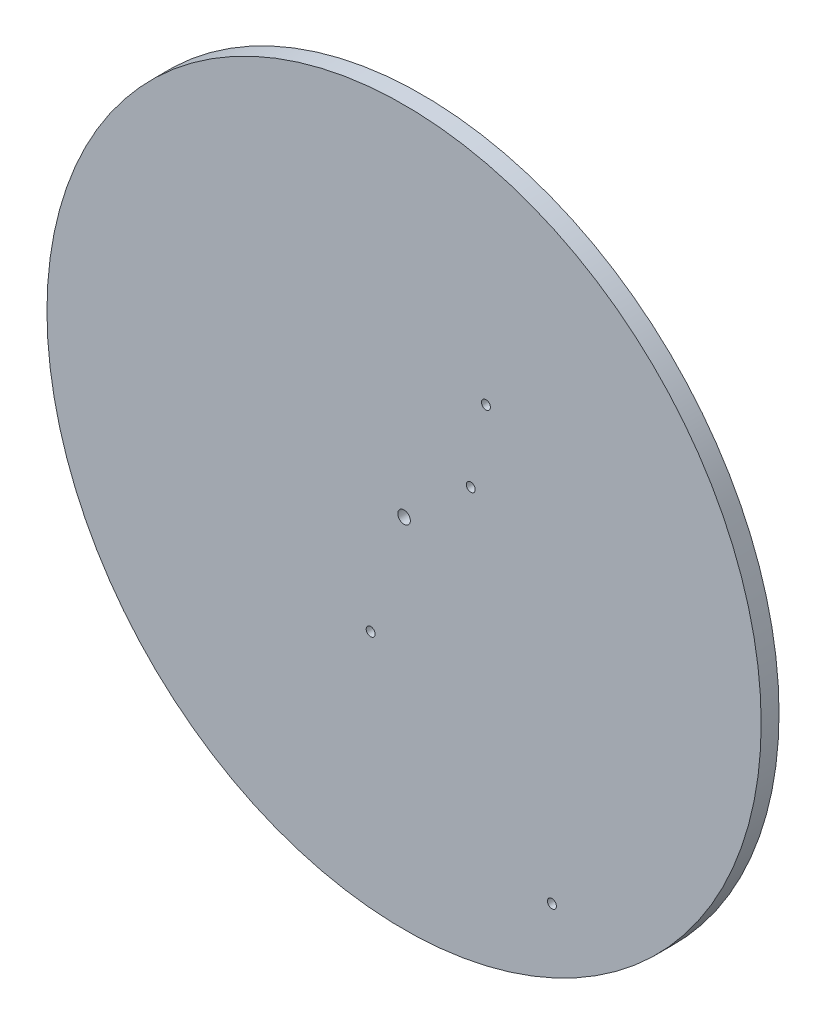
ISO-10303-21;
HEADER;
FILE_DESCRIPTION(('STEP AP214'),'2;1');
FILE_NAME('part.step','',(''),(''),'','','');
FILE_SCHEMA(('AUTOMOTIVE_DESIGN { 1 0 10303 214 1 1 1 1 }'));
ENDSEC;
DATA;
#1=APPLICATION_CONTEXT('core data for automotive mechanical design processes');
#2=APPLICATION_PROTOCOL_DEFINITION('international standard','automotive_design',2000,#1);
#3=PRODUCT_CONTEXT('',#1,'mechanical');
#4=PRODUCT('Part','Part','',(#3));
#5=PRODUCT_RELATED_PRODUCT_CATEGORY('part','',(#4));
#6=PRODUCT_DEFINITION_FORMATION('','',#4);
#7=PRODUCT_DEFINITION_CONTEXT('part definition',#1,'design');
#8=PRODUCT_DEFINITION('design','',#6,#7);
#9=PRODUCT_DEFINITION_SHAPE('','',#8);
#10=(LENGTH_UNIT() NAMED_UNIT(*) SI_UNIT(.MILLI.,.METRE.));
#11=(NAMED_UNIT(*) PLANE_ANGLE_UNIT() SI_UNIT($,.RADIAN.));
#12=(NAMED_UNIT(*) SI_UNIT($,.STERADIAN.) SOLID_ANGLE_UNIT());
#13=UNCERTAINTY_MEASURE_WITH_UNIT(LENGTH_MEASURE(1.E-05),#10,'distance_accuracy_value','');
#14=(GEOMETRIC_REPRESENTATION_CONTEXT(3) GLOBAL_UNCERTAINTY_ASSIGNED_CONTEXT((#13)) GLOBAL_UNIT_ASSIGNED_CONTEXT((#10,
#11,#12)) REPRESENTATION_CONTEXT('',''));
#15=CARTESIAN_POINT('',(0.,0.,0.));
#16=DIRECTION('',(0.,0.,1.));
#17=DIRECTION('',(1.,0.,0.));
#18=AXIS2_PLACEMENT_3D('',#15,#16,#17);
#19=CARTESIAN_POINT('',(0.,0.,10.));
#20=DIRECTION('',(0.,0.,1.));
#21=DIRECTION('',(1.,0.,0.));
#22=AXIS2_PLACEMENT_3D('',#19,#20,#21);
#23=PLANE('',#22);
#24=CARTESIAN_POINT('',(82.82,-146.05,10.));
#25=DIRECTION('',(0.,0.,1.));
#26=DIRECTION('',(1.,0.,0.));
#27=AXIS2_PLACEMENT_3D('',#24,#25,#26);
#28=CIRCLE('',#27,2.50000000000001);
#29=CARTESIAN_POINT('',(85.32,-146.05,10.));
#30=VERTEX_POINT('',#29);
#31=EDGE_CURVE('E71',#30,#30,#28,.T.);
#32=ORIENTED_EDGE('',*,*,#31,.F.);
#33=EDGE_LOOP('',(#32));
#34=FACE_BOUND('',#33,.T.);
#35=CARTESIAN_POINT('',(-18.71,-64.86,10.));
#36=DIRECTION('',(0.,0.,1.));
#37=DIRECTION('',(1.,0.,0.));
#38=AXIS2_PLACEMENT_3D('',#35,#36,#37);
#39=CIRCLE('',#38,2.5);
#40=CARTESIAN_POINT('',(-16.21,-64.86,10.));
#41=VERTEX_POINT('',#40);
#42=EDGE_CURVE('E65',#41,#41,#39,.T.);
#43=ORIENTED_EDGE('',*,*,#42,.F.);
#44=EDGE_LOOP('',(#43));
#45=FACE_BOUND('',#44,.T.);
#46=CARTESIAN_POINT('',(45.86,77.44,10.));
#47=DIRECTION('',(0.,0.,1.));
#48=DIRECTION('',(1.,0.,0.));
#49=AXIS2_PLACEMENT_3D('',#46,#47,#48);
#50=CIRCLE('',#49,2.5);
#51=CARTESIAN_POINT('',(48.36,77.44,10.));
#52=VERTEX_POINT('',#51);
#53=EDGE_CURVE('E59',#52,#52,#50,.T.);
#54=ORIENTED_EDGE('',*,*,#53,.F.);
#55=EDGE_LOOP('',(#54));
#56=FACE_BOUND('',#55,.T.);
#57=CARTESIAN_POINT('',(37.34,33.25,10.));
#58=DIRECTION('',(0.,0.,1.));
#59=DIRECTION('',(1.,0.,0.));
#60=AXIS2_PLACEMENT_3D('',#57,#58,#59);
#61=CIRCLE('',#60,2.5);
#62=CARTESIAN_POINT('',(39.84,33.25,10.));
#63=VERTEX_POINT('',#62);
#64=EDGE_CURVE('E53',#63,#63,#61,.T.);
#65=ORIENTED_EDGE('',*,*,#64,.F.);
#66=EDGE_LOOP('',(#65));
#67=FACE_BOUND('',#66,.T.);
#68=CARTESIAN_POINT('',(0.,0.,10.));
#69=DIRECTION('',(0.,0.,1.));
#70=DIRECTION('',(1.,0.,0.));
#71=AXIS2_PLACEMENT_3D('',#68,#69,#70);
#72=CIRCLE('',#71,200.);
#73=CARTESIAN_POINT('',(200.,0.,10.));
#74=VERTEX_POINT('',#73);
#75=EDGE_CURVE('E10',#74,#74,#72,.T.);
#76=ORIENTED_EDGE('',*,*,#75,.T.);
#77=EDGE_LOOP('',(#76));
#78=FACE_BOUND('',#77,.T.);
#79=CARTESIAN_POINT('',(0.,0.,10.));
#80=DIRECTION('',(0.,0.,1.));
#81=DIRECTION('',(1.,0.,0.));
#82=AXIS2_PLACEMENT_3D('',#79,#80,#81);
#83=CIRCLE('',#82,3.5);
#84=CARTESIAN_POINT('',(3.5,0.,10.));
#85=VERTEX_POINT('',#84);
#86=EDGE_CURVE('E45',#85,#85,#83,.T.);
#87=ORIENTED_EDGE('',*,*,#86,.F.);
#88=EDGE_LOOP('',(#87));
#89=FACE_BOUND('',#88,.T.);
#90=ADVANCED_FACE('F34',(#34,#45,#56,#67,#78,#89),#23,.T.);
#91=CARTESIAN_POINT('',(0.,0.,0.));
#92=DIRECTION('',(0.,0.,1.));
#93=DIRECTION('',(1.,0.,0.));
#94=AXIS2_PLACEMENT_3D('',#91,#92,#93);
#95=PLANE('',#94);
#96=CARTESIAN_POINT('',(82.82,-146.05,0.));
#97=DIRECTION('',(0.,0.,1.));
#98=DIRECTION('',(1.,0.,0.));
#99=AXIS2_PLACEMENT_3D('',#96,#97,#98);
#100=CIRCLE('',#99,2.50000000000001);
#101=CARTESIAN_POINT('',(85.32,-146.05,0.));
#102=VERTEX_POINT('',#101);
#103=EDGE_CURVE('E68',#102,#102,#100,.T.);
#104=ORIENTED_EDGE('',*,*,#103,.T.);
#105=EDGE_LOOP('',(#104));
#106=FACE_BOUND('',#105,.T.);
#107=CARTESIAN_POINT('',(-18.71,-64.86,0.));
#108=DIRECTION('',(0.,0.,1.));
#109=DIRECTION('',(1.,0.,0.));
#110=AXIS2_PLACEMENT_3D('',#107,#108,#109);
#111=CIRCLE('',#110,2.5);
#112=CARTESIAN_POINT('',(-16.21,-64.86,0.));
#113=VERTEX_POINT('',#112);
#114=EDGE_CURVE('E62',#113,#113,#111,.T.);
#115=ORIENTED_EDGE('',*,*,#114,.T.);
#116=EDGE_LOOP('',(#115));
#117=FACE_BOUND('',#116,.T.);
#118=CARTESIAN_POINT('',(45.86,77.44,0.));
#119=DIRECTION('',(0.,0.,1.));
#120=DIRECTION('',(1.,0.,0.));
#121=AXIS2_PLACEMENT_3D('',#118,#119,#120);
#122=CIRCLE('',#121,2.5);
#123=CARTESIAN_POINT('',(48.36,77.44,0.));
#124=VERTEX_POINT('',#123);
#125=EDGE_CURVE('E56',#124,#124,#122,.T.);
#126=ORIENTED_EDGE('',*,*,#125,.T.);
#127=EDGE_LOOP('',(#126));
#128=FACE_BOUND('',#127,.T.);
#129=CARTESIAN_POINT('',(37.34,33.25,0.));
#130=DIRECTION('',(0.,0.,1.));
#131=DIRECTION('',(1.,0.,0.));
#132=AXIS2_PLACEMENT_3D('',#129,#130,#131);
#133=CIRCLE('',#132,2.5);
#134=CARTESIAN_POINT('',(39.84,33.25,0.));
#135=VERTEX_POINT('',#134);
#136=EDGE_CURVE('E50',#135,#135,#133,.T.);
#137=ORIENTED_EDGE('',*,*,#136,.T.);
#138=EDGE_LOOP('',(#137));
#139=FACE_BOUND('',#138,.T.);
#140=CARTESIAN_POINT('',(0.,0.,0.));
#141=DIRECTION('',(0.,0.,1.));
#142=DIRECTION('',(1.,0.,0.));
#143=AXIS2_PLACEMENT_3D('',#140,#141,#142);
#144=CIRCLE('',#143,200.);
#145=CARTESIAN_POINT('',(200.,0.,0.));
#146=VERTEX_POINT('',#145);
#147=EDGE_CURVE('E38',#146,#146,#144,.T.);
#148=ORIENTED_EDGE('',*,*,#147,.F.);
#149=EDGE_LOOP('',(#148));
#150=FACE_BOUND('',#149,.T.);
#151=CARTESIAN_POINT('',(0.,0.,0.));
#152=DIRECTION('',(0.,0.,1.));
#153=DIRECTION('',(1.,0.,0.));
#154=AXIS2_PLACEMENT_3D('',#151,#152,#153);
#155=CIRCLE('',#154,3.5);
#156=CARTESIAN_POINT('',(3.5,0.,0.));
#157=VERTEX_POINT('',#156);
#158=EDGE_CURVE('E47',#157,#157,#155,.T.);
#159=ORIENTED_EDGE('',*,*,#158,.T.);
#160=EDGE_LOOP('',(#159));
#161=FACE_BOUND('',#160,.T.);
#162=ADVANCED_FACE('F77',(#106,#117,#128,#139,#150,#161),#95,.F.);
#163=CARTESIAN_POINT('',(0.,0.,10.));
#164=DIRECTION('',(0.,0.,-1.));
#165=DIRECTION('',(-1.,0.,0.));
#166=AXIS2_PLACEMENT_3D('',#163,#164,#165);
#167=CYLINDRICAL_SURFACE('',#166,200.);
#168=ORIENTED_EDGE('',*,*,#75,.F.);
#169=EDGE_LOOP('',(#168));
#170=FACE_BOUND('',#169,.T.);
#171=ORIENTED_EDGE('',*,*,#147,.T.);
#172=EDGE_LOOP('',(#171));
#173=FACE_BOUND('',#172,.T.);
#174=ADVANCED_FACE('F36',(#170,#173),#167,.T.);
#175=CARTESIAN_POINT('',(0.,0.,10.));
#176=DIRECTION('',(0.,0.,-1.));
#177=DIRECTION('',(-1.,0.,0.));
#178=AXIS2_PLACEMENT_3D('',#175,#176,#177);
#179=CYLINDRICAL_SURFACE('',#178,3.5);
#180=ORIENTED_EDGE('',*,*,#86,.T.);
#181=EDGE_LOOP('',(#180));
#182=FACE_BOUND('',#181,.T.);
#183=ORIENTED_EDGE('',*,*,#158,.F.);
#184=EDGE_LOOP('',(#183));
#185=FACE_BOUND('',#184,.T.);
#186=ADVANCED_FACE('F98',(#182,#185),#179,.F.);
#187=CARTESIAN_POINT('',(37.34,33.25,0.));
#188=DIRECTION('',(0.,0.,1.));
#189=DIRECTION('',(1.,0.,0.));
#190=AXIS2_PLACEMENT_3D('',#187,#188,#189);
#191=CYLINDRICAL_SURFACE('',#190,2.5);
#192=ORIENTED_EDGE('',*,*,#136,.F.);
#193=EDGE_LOOP('',(#192));
#194=FACE_BOUND('',#193,.T.);
#195=ORIENTED_EDGE('',*,*,#64,.T.);
#196=EDGE_LOOP('',(#195));
#197=FACE_BOUND('',#196,.T.);
#198=ADVANCED_FACE('F101',(#194,#197),#191,.F.);
#199=CARTESIAN_POINT('',(45.86,77.44,0.));
#200=DIRECTION('',(0.,0.,1.));
#201=DIRECTION('',(1.,0.,0.));
#202=AXIS2_PLACEMENT_3D('',#199,#200,#201);
#203=CYLINDRICAL_SURFACE('',#202,2.5);
#204=ORIENTED_EDGE('',*,*,#125,.F.);
#205=EDGE_LOOP('',(#204));
#206=FACE_BOUND('',#205,.T.);
#207=ORIENTED_EDGE('',*,*,#53,.T.);
#208=EDGE_LOOP('',(#207));
#209=FACE_BOUND('',#208,.T.);
#210=ADVANCED_FACE('F113',(#206,#209),#203,.F.);
#211=CARTESIAN_POINT('',(-18.71,-64.86,0.));
#212=DIRECTION('',(0.,0.,1.));
#213=DIRECTION('',(1.,0.,0.));
#214=AXIS2_PLACEMENT_3D('',#211,#212,#213);
#215=CYLINDRICAL_SURFACE('',#214,2.5);
#216=ORIENTED_EDGE('',*,*,#114,.F.);
#217=EDGE_LOOP('',(#216));
#218=FACE_BOUND('',#217,.T.);
#219=ORIENTED_EDGE('',*,*,#42,.T.);
#220=EDGE_LOOP('',(#219));
#221=FACE_BOUND('',#220,.T.);
#222=ADVANCED_FACE('F83',(#218,#221),#215,.F.);
#223=CARTESIAN_POINT('',(82.82,-146.05,0.));
#224=DIRECTION('',(0.,0.,1.));
#225=DIRECTION('',(1.,0.,0.));
#226=AXIS2_PLACEMENT_3D('',#223,#224,#225);
#227=CYLINDRICAL_SURFACE('',#226,2.50000000000001);
#228=ORIENTED_EDGE('',*,*,#103,.F.);
#229=EDGE_LOOP('',(#228));
#230=FACE_BOUND('',#229,.T.);
#231=ORIENTED_EDGE('',*,*,#31,.T.);
#232=EDGE_LOOP('',(#231));
#233=FACE_BOUND('',#232,.T.);
#234=ADVANCED_FACE('F80',(#230,#233),#227,.F.);
#235=CLOSED_SHELL('',(#90,#162,#174,#186,#198,#210,#222,#234));
#236=MANIFOLD_SOLID_BREP('B2',#235);
#237=ADVANCED_BREP_SHAPE_REPRESENTATION('',(#18,#236),#14);
#238=SHAPE_DEFINITION_REPRESENTATION(#9,#237);
ENDSEC;
END-ISO-10303-21;
